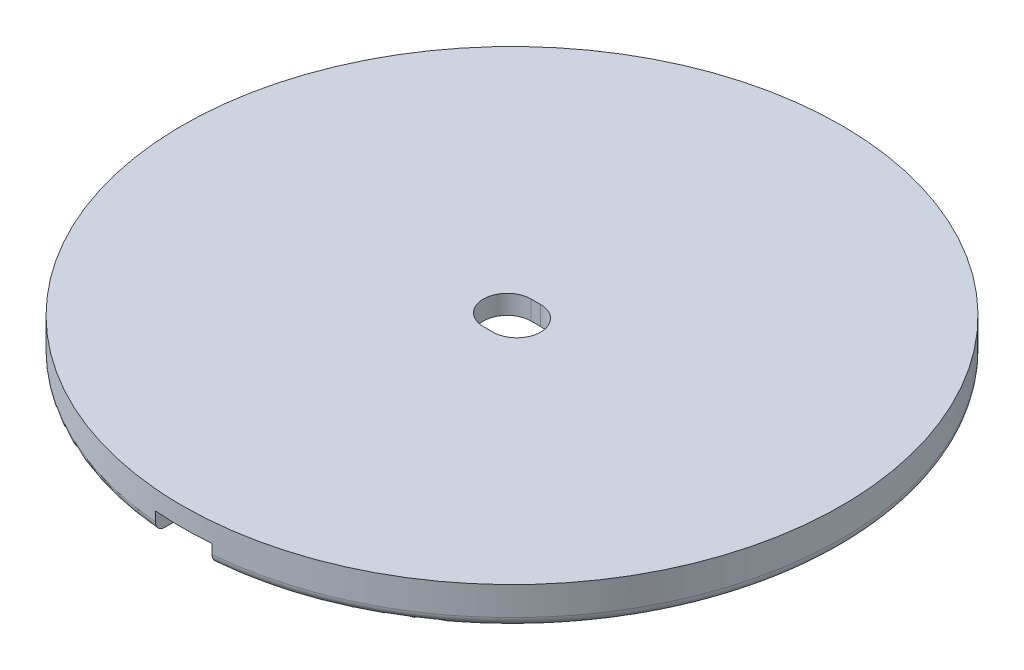
ISO-10303-21;
HEADER;
FILE_DESCRIPTION(('STEP AP214'),'2;1');
FILE_NAME('part.step','',(''),(''),'','','');
FILE_SCHEMA(('AUTOMOTIVE_DESIGN { 1 0 10303 214 1 1 1 1 }'));
ENDSEC;
DATA;
#1=APPLICATION_CONTEXT('core data for automotive mechanical design processes');
#2=APPLICATION_PROTOCOL_DEFINITION('international standard','automotive_design',2000,#1);
#3=PRODUCT_CONTEXT('',#1,'mechanical');
#4=PRODUCT('Part','Part','',(#3));
#5=PRODUCT_RELATED_PRODUCT_CATEGORY('part','',(#4));
#6=PRODUCT_DEFINITION_FORMATION('','',#4);
#7=PRODUCT_DEFINITION_CONTEXT('part definition',#1,'design');
#8=PRODUCT_DEFINITION('design','',#6,#7);
#9=PRODUCT_DEFINITION_SHAPE('','',#8);
#10=(LENGTH_UNIT() NAMED_UNIT(*) SI_UNIT(.MILLI.,.METRE.));
#11=(NAMED_UNIT(*) PLANE_ANGLE_UNIT() SI_UNIT($,.RADIAN.));
#12=(NAMED_UNIT(*) SI_UNIT($,.STERADIAN.) SOLID_ANGLE_UNIT());
#13=UNCERTAINTY_MEASURE_WITH_UNIT(LENGTH_MEASURE(1.E-05),#10,'distance_accuracy_value','');
#14=(GEOMETRIC_REPRESENTATION_CONTEXT(3) GLOBAL_UNCERTAINTY_ASSIGNED_CONTEXT((#13)) GLOBAL_UNIT_ASSIGNED_CONTEXT((#10,
#11,#12)) REPRESENTATION_CONTEXT('',''));
#15=CARTESIAN_POINT('',(0.,0.,0.));
#16=DIRECTION('',(0.,0.,1.));
#17=DIRECTION('',(1.,0.,0.));
#18=AXIS2_PLACEMENT_3D('',#15,#16,#17);
#19=CARTESIAN_POINT('',(0.500000000000001,0.,0.));
#20=DIRECTION('',(0.,1.,0.));
#21=DIRECTION('',(0.,0.,1.));
#22=AXIS2_PLACEMENT_3D('',#19,#20,#21);
#23=CYLINDRICAL_SURFACE('',#22,2.5);
#24=CARTESIAN_POINT('',(0.500000000000001,2.,0.));
#25=DIRECTION('',(0.,-1.,0.));
#26=DIRECTION('',(0.,0.,-1.));
#27=AXIS2_PLACEMENT_3D('',#24,#25,#26);
#28=CIRCLE('',#27,2.5);
#29=CARTESIAN_POINT('',(0.500000000000001,2.,2.5));
#30=VERTEX_POINT('',#29);
#31=CARTESIAN_POINT('',(0.5,2.,-2.5));
#32=VERTEX_POINT('',#31);
#33=EDGE_CURVE('E170',#30,#32,#28,.F.);
#34=ORIENTED_EDGE('',*,*,#33,.F.);
#35=DIRECTION('',(0.,1.,0.));
#36=VECTOR('',#35,1.);
#37=CARTESIAN_POINT('',(0.500000000000001,0.,2.5));
#38=LINE('',#37,#36);
#39=CARTESIAN_POINT('',(0.500000000000001,4.,2.5));
#40=VERTEX_POINT('',#39);
#41=EDGE_CURVE('E197',#30,#40,#38,.T.);
#42=ORIENTED_EDGE('',*,*,#41,.T.);
#43=CARTESIAN_POINT('',(0.500000000000001,4.,0.));
#44=DIRECTION('',(0.,1.,0.));
#45=DIRECTION('',(0.,0.,1.));
#46=AXIS2_PLACEMENT_3D('',#43,#44,#45);
#47=CIRCLE('',#46,2.5);
#48=CARTESIAN_POINT('',(0.5,4.,-2.5));
#49=VERTEX_POINT('',#48);
#50=EDGE_CURVE('E181',#40,#49,#47,.T.);
#51=ORIENTED_EDGE('',*,*,#50,.T.);
#52=DIRECTION('',(0.,1.,0.));
#53=VECTOR('',#52,1.);
#54=CARTESIAN_POINT('',(0.5,0.,-2.5));
#55=LINE('',#54,#53);
#56=EDGE_CURVE('E196',#32,#49,#55,.T.);
#57=ORIENTED_EDGE('',*,*,#56,.F.);
#58=EDGE_LOOP('',(#34,#42,#51,#57));
#59=FACE_BOUND('',#58,.T.);
#60=ADVANCED_FACE('F38',(#59),#23,.F.);
#61=CARTESIAN_POINT('',(0.500000000000001,0.,2.5));
#62=DIRECTION('',(0.,0.,1.));
#63=DIRECTION('',(1.,0.,0.));
#64=AXIS2_PLACEMENT_3D('',#61,#62,#63);
#65=PLANE('',#64);
#66=DIRECTION('',(1.,0.,0.));
#67=VECTOR('',#66,1.);
#68=CARTESIAN_POINT('',(0.,2.,2.5));
#69=LINE('',#68,#67);
#70=CARTESIAN_POINT('',(-0.500000000000001,2.,2.5));
#71=VERTEX_POINT('',#70);
#72=EDGE_CURVE('E300',#71,#30,#69,.T.);
#73=ORIENTED_EDGE('',*,*,#72,.F.);
#74=DIRECTION('',(0.,1.,0.));
#75=VECTOR('',#74,1.);
#76=CARTESIAN_POINT('',(-0.5,0.,2.5));
#77=LINE('',#76,#75);
#78=CARTESIAN_POINT('',(-0.5,4.,2.5));
#79=VERTEX_POINT('',#78);
#80=EDGE_CURVE('E200',#71,#79,#77,.T.);
#81=ORIENTED_EDGE('',*,*,#80,.T.);
#82=DIRECTION('',(1.,0.,0.));
#83=VECTOR('',#82,1.);
#84=CARTESIAN_POINT('',(0.500000000000001,4.,2.5));
#85=LINE('',#84,#83);
#86=EDGE_CURVE('E193',#79,#40,#85,.T.);
#87=ORIENTED_EDGE('',*,*,#86,.T.);
#88=ORIENTED_EDGE('',*,*,#41,.F.);
#89=EDGE_LOOP('',(#73,#81,#87,#88));
#90=FACE_BOUND('',#89,.T.);
#91=ADVANCED_FACE('F239',(#90),#65,.F.);
#92=CARTESIAN_POINT('',(-0.500000000000001,0.,0.));
#93=DIRECTION('',(0.,1.,0.));
#94=DIRECTION('',(0.,0.,1.));
#95=AXIS2_PLACEMENT_3D('',#92,#93,#94);
#96=CYLINDRICAL_SURFACE('',#95,2.5);
#97=CARTESIAN_POINT('',(-0.500000000000001,2.,0.));
#98=DIRECTION('',(0.,-1.,0.));
#99=DIRECTION('',(0.,0.,-1.));
#100=AXIS2_PLACEMENT_3D('',#97,#98,#99);
#101=CIRCLE('',#100,2.5);
#102=CARTESIAN_POINT('',(-0.500000000000001,2.,-2.5));
#103=VERTEX_POINT('',#102);
#104=EDGE_CURVE('E176',#103,#71,#101,.F.);
#105=ORIENTED_EDGE('',*,*,#104,.F.);
#106=DIRECTION('',(0.,1.,0.));
#107=VECTOR('',#106,1.);
#108=CARTESIAN_POINT('',(-0.5,0.,-2.5));
#109=LINE('',#108,#107);
#110=CARTESIAN_POINT('',(-0.5,4.,-2.5));
#111=VERTEX_POINT('',#110);
#112=EDGE_CURVE('E202',#103,#111,#109,.T.);
#113=ORIENTED_EDGE('',*,*,#112,.T.);
#114=CARTESIAN_POINT('',(-0.500000000000001,4.,0.));
#115=DIRECTION('',(0.,1.,0.));
#116=DIRECTION('',(0.,0.,1.));
#117=AXIS2_PLACEMENT_3D('',#114,#115,#116);
#118=CIRCLE('',#117,2.5);
#119=EDGE_CURVE('E190',#111,#79,#118,.T.);
#120=ORIENTED_EDGE('',*,*,#119,.T.);
#121=ORIENTED_EDGE('',*,*,#80,.F.);
#122=EDGE_LOOP('',(#105,#113,#120,#121));
#123=FACE_BOUND('',#122,.T.);
#124=ADVANCED_FACE('F242',(#123),#96,.F.);
#125=CARTESIAN_POINT('',(0.5,0.,-2.5));
#126=DIRECTION('',(0.,0.,-1.));
#127=DIRECTION('',(-1.,0.,0.));
#128=AXIS2_PLACEMENT_3D('',#125,#126,#127);
#129=PLANE('',#128);
#130=DIRECTION('',(-1.,0.,0.));
#131=VECTOR('',#130,1.);
#132=CARTESIAN_POINT('',(0.,2.,-2.5));
#133=LINE('',#132,#131);
#134=EDGE_CURVE('E165',#32,#103,#133,.T.);
#135=ORIENTED_EDGE('',*,*,#134,.F.);
#136=ORIENTED_EDGE('',*,*,#56,.T.);
#137=DIRECTION('',(-1.,0.,0.));
#138=VECTOR('',#137,1.);
#139=CARTESIAN_POINT('',(0.5,4.,-2.5));
#140=LINE('',#139,#138);
#141=EDGE_CURVE('E187',#49,#111,#140,.T.);
#142=ORIENTED_EDGE('',*,*,#141,.T.);
#143=ORIENTED_EDGE('',*,*,#112,.F.);
#144=EDGE_LOOP('',(#135,#136,#142,#143));
#145=FACE_BOUND('',#144,.T.);
#146=ADVANCED_FACE('F246',(#145),#129,.F.);
#147=CARTESIAN_POINT('',(0.,4.,0.));
#148=DIRECTION('',(0.,-1.,0.));
#149=DIRECTION('',(0.,0.,-1.));
#150=AXIS2_PLACEMENT_3D('',#147,#148,#149);
#151=CYLINDRICAL_SURFACE('',#150,34.5);
#152=CARTESIAN_POINT('',(0.,4.,0.));
#153=DIRECTION('',(0.,1.,0.));
#154=DIRECTION('',(0.,0.,1.));
#155=AXIS2_PLACEMENT_3D('',#152,#153,#154);
#156=CIRCLE('',#155,34.5);
#157=CARTESIAN_POINT('',(0.,4.,34.5));
#158=VERTEX_POINT('',#157);
#159=EDGE_CURVE('E199',#158,#158,#156,.T.);
#160=ORIENTED_EDGE('',*,*,#159,.F.);
#161=EDGE_LOOP('',(#160));
#162=FACE_BOUND('',#161,.T.);
#163=DIRECTION('',(0.,-1.,0.));
#164=VECTOR('',#163,1.);
#165=CARTESIAN_POINT('',(2.96579845369393,4.,34.3722859224124));
#166=LINE('',#165,#164);
#167=CARTESIAN_POINT('',(2.96579845369393,2.,34.3722859224123));
#168=VERTEX_POINT('',#167);
#169=CARTESIAN_POINT('',(2.96579845369393,1.,34.3722859224124));
#170=VERTEX_POINT('',#169);
#171=EDGE_CURVE('E268',#168,#170,#166,.T.);
#172=ORIENTED_EDGE('',*,*,#171,.T.);
#173=CARTESIAN_POINT('',(0.,1.,0.));
#174=DIRECTION('',(0.,1.,0.));
#175=DIRECTION('',(0.,0.,1.));
#176=AXIS2_PLACEMENT_3D('',#173,#174,#175);
#177=CIRCLE('',#176,34.5);
#178=CARTESIAN_POINT('',(-2.96579845369394,1.,34.3722859224124));
#179=VERTEX_POINT('',#178);
#180=EDGE_CURVE('E208',#170,#179,#177,.T.);
#181=ORIENTED_EDGE('',*,*,#180,.T.);
#182=DIRECTION('',(0.,-1.,0.));
#183=VECTOR('',#182,1.);
#184=CARTESIAN_POINT('',(-2.96579845369394,4.,34.3722859224124));
#185=LINE('',#184,#183);
#186=CARTESIAN_POINT('',(-2.96579845369393,2.,34.3722859224123));
#187=VERTEX_POINT('',#186);
#188=EDGE_CURVE('E294',#179,#187,#185,.F.);
#189=ORIENTED_EDGE('',*,*,#188,.T.);
#190=CARTESIAN_POINT('',(0.,2.,0.));
#191=DIRECTION('',(0.,-1.,0.));
#192=DIRECTION('',(0.,0.,-1.));
#193=AXIS2_PLACEMENT_3D('',#190,#191,#192);
#194=CIRCLE('',#193,34.5);
#195=EDGE_CURVE('E177',#168,#187,#194,.T.);
#196=ORIENTED_EDGE('',*,*,#195,.F.);
#197=EDGE_LOOP('',(#172,#181,#189,#196));
#198=FACE_BOUND('',#197,.T.);
#199=ADVANCED_FACE('F250',(#162,#198),#151,.T.);
#200=CARTESIAN_POINT('',(0.,4.,0.));
#201=DIRECTION('',(0.,1.,0.));
#202=DIRECTION('',(0.,0.,1.));
#203=AXIS2_PLACEMENT_3D('',#200,#201,#202);
#204=PLANE('',#203);
#205=ORIENTED_EDGE('',*,*,#50,.F.);
#206=ORIENTED_EDGE('',*,*,#86,.F.);
#207=ORIENTED_EDGE('',*,*,#119,.F.);
#208=ORIENTED_EDGE('',*,*,#141,.F.);
#209=EDGE_LOOP('',(#205,#206,#207,#208));
#210=FACE_BOUND('',#209,.T.);
#211=ORIENTED_EDGE('',*,*,#159,.T.);
#212=EDGE_LOOP('',(#211));
#213=FACE_BOUND('',#212,.T.);
#214=ADVANCED_FACE('F255',(#210,#213),#204,.T.);
#215=CARTESIAN_POINT('',(0.,0.,0.));
#216=DIRECTION('',(0.,1.,0.));
#217=DIRECTION('',(0.,0.,1.));
#218=AXIS2_PLACEMENT_3D('',#215,#216,#217);
#219=PLANE('',#218);
#220=DIRECTION('',(0.,0.,-1.));
#221=VECTOR('',#220,1.);
#222=CARTESIAN_POINT('',(-2.96579845369394,0.,6.88868924629836));
#223=LINE('',#222,#221);
#224=CARTESIAN_POINT('',(-2.96579845369394,0.,33.3684587527213));
#225=VERTEX_POINT('',#224);
#226=CARTESIAN_POINT('',(-2.96579845369393,0.,32.3643946263802));
#227=VERTEX_POINT('',#226);
#228=EDGE_CURVE('E283',#225,#227,#223,.T.);
#229=ORIENTED_EDGE('',*,*,#228,.F.);
#230=CARTESIAN_POINT('',(0.,0.,0.));
#231=DIRECTION('',(0.,1.,0.));
#232=DIRECTION('',(0.,0.,1.));
#233=AXIS2_PLACEMENT_3D('',#230,#231,#232);
#234=CIRCLE('',#233,33.5);
#235=CARTESIAN_POINT('',(2.96579845369393,0.,33.3684587527213));
#236=VERTEX_POINT('',#235);
#237=EDGE_CURVE('E52',#225,#236,#234,.F.);
#238=ORIENTED_EDGE('',*,*,#237,.T.);
#239=DIRECTION('',(0.,0.,1.));
#240=VECTOR('',#239,1.);
#241=CARTESIAN_POINT('',(2.96579845369393,0.,6.88868924629836));
#242=LINE('',#241,#240);
#243=CARTESIAN_POINT('',(2.96579845369393,0.,32.3643946263802));
#244=VERTEX_POINT('',#243);
#245=EDGE_CURVE('E277',#244,#236,#242,.T.);
#246=ORIENTED_EDGE('',*,*,#245,.F.);
#247=CARTESIAN_POINT('',(0.,0.,0.));
#248=DIRECTION('',(0.,-1.,0.));
#249=DIRECTION('',(0.,0.,-1.));
#250=AXIS2_PLACEMENT_3D('',#247,#248,#249);
#251=CIRCLE('',#250,32.5);
#252=EDGE_CURVE('E168',#227,#244,#251,.T.);
#253=ORIENTED_EDGE('',*,*,#252,.F.);
#254=EDGE_LOOP('',(#229,#238,#246,#253));
#255=FACE_BOUND('',#254,.T.);
#256=ADVANCED_FACE('F231',(#255),#219,.F.);
#257=CARTESIAN_POINT('',(0.,2.,0.));
#258=DIRECTION('',(0.,-1.,0.));
#259=DIRECTION('',(0.,0.,-1.));
#260=AXIS2_PLACEMENT_3D('',#257,#258,#259);
#261=CYLINDRICAL_SURFACE('',#260,7.5);
#262=CARTESIAN_POINT('',(0.,0.,0.));
#263=DIRECTION('',(0.,-1.,0.));
#264=DIRECTION('',(0.,0.,-1.));
#265=AXIS2_PLACEMENT_3D('',#262,#263,#264);
#266=CIRCLE('',#265,7.5);
#267=CARTESIAN_POINT('',(-2.96579845369394,0.,6.88868924629836));
#268=VERTEX_POINT('',#267);
#269=CARTESIAN_POINT('',(2.96579845369393,0.,6.88868924629836));
#270=VERTEX_POINT('',#269);
#271=EDGE_CURVE('E174',#268,#270,#266,.T.);
#272=ORIENTED_EDGE('',*,*,#271,.T.);
#273=DIRECTION('',(0.,-1.,0.));
#274=VECTOR('',#273,1.);
#275=CARTESIAN_POINT('',(2.96579845369393,2.,6.88868924629836));
#276=LINE('',#275,#274);
#277=CARTESIAN_POINT('',(2.96579845369393,2.,6.88868924629836));
#278=VERTEX_POINT('',#277);
#279=EDGE_CURVE('E160',#278,#270,#276,.T.);
#280=ORIENTED_EDGE('',*,*,#279,.F.);
#281=CARTESIAN_POINT('',(0.,2.,0.));
#282=DIRECTION('',(0.,-1.,0.));
#283=DIRECTION('',(0.,0.,-1.));
#284=AXIS2_PLACEMENT_3D('',#281,#282,#283);
#285=CIRCLE('',#284,7.5);
#286=CARTESIAN_POINT('',(-2.96579845369394,2.,6.88868924629836));
#287=VERTEX_POINT('',#286);
#288=EDGE_CURVE('E144',#287,#278,#285,.T.);
#289=ORIENTED_EDGE('',*,*,#288,.F.);
#290=DIRECTION('',(0.,-1.,0.));
#291=VECTOR('',#290,1.);
#292=CARTESIAN_POINT('',(-2.96579845369394,2.,6.88868924629836));
#293=LINE('',#292,#291);
#294=EDGE_CURVE('E153',#287,#268,#293,.T.);
#295=ORIENTED_EDGE('',*,*,#294,.T.);
#296=EDGE_LOOP('',(#272,#280,#289,#295));
#297=FACE_BOUND('',#296,.T.);
#298=ADVANCED_FACE('F163',(#297),#261,.F.);
#299=CARTESIAN_POINT('',(0.,2.,0.));
#300=DIRECTION('',(0.,-1.,0.));
#301=DIRECTION('',(0.,0.,-1.));
#302=AXIS2_PLACEMENT_3D('',#299,#300,#301);
#303=PLANE('',#302);
#304=ORIENTED_EDGE('',*,*,#288,.T.);
#305=DIRECTION('',(0.,0.,1.));
#306=VECTOR('',#305,1.);
#307=CARTESIAN_POINT('',(2.96579845369393,2.,6.88868924629836));
#308=LINE('',#307,#306);
#309=CARTESIAN_POINT('',(2.96579845369393,2.,12.1430654915498));
#310=VERTEX_POINT('',#309);
#311=EDGE_CURVE('E150',#278,#310,#308,.T.);
#312=ORIENTED_EDGE('',*,*,#311,.T.);
#313=CARTESIAN_POINT('',(0.,2.,0.));
#314=DIRECTION('',(0.,-1.,0.));
#315=DIRECTION('',(0.,0.,-1.));
#316=AXIS2_PLACEMENT_3D('',#313,#314,#315);
#317=CIRCLE('',#316,12.5);
#318=CARTESIAN_POINT('',(-2.96579845369394,2.,12.1430654915498));
#319=VERTEX_POINT('',#318);
#320=EDGE_CURVE('E146',#319,#310,#317,.T.);
#321=ORIENTED_EDGE('',*,*,#320,.F.);
#322=DIRECTION('',(0.,0.,-1.));
#323=VECTOR('',#322,1.);
#324=CARTESIAN_POINT('',(-2.96579845369394,2.,6.88868924629836));
#325=LINE('',#324,#323);
#326=EDGE_CURVE('E138',#319,#287,#325,.T.);
#327=ORIENTED_EDGE('',*,*,#326,.T.);
#328=EDGE_LOOP('',(#304,#312,#321,#327));
#329=FACE_BOUND('',#328,.T.);
#330=ORIENTED_EDGE('',*,*,#104,.T.);
#331=ORIENTED_EDGE('',*,*,#72,.T.);
#332=ORIENTED_EDGE('',*,*,#33,.T.);
#333=ORIENTED_EDGE('',*,*,#134,.T.);
#334=EDGE_LOOP('',(#330,#331,#332,#333));
#335=FACE_BOUND('',#334,.T.);
#336=CARTESIAN_POINT('',(0.,2.,0.));
#337=DIRECTION('',(0.,-1.,0.));
#338=DIRECTION('',(0.,0.,-1.));
#339=AXIS2_PLACEMENT_3D('',#336,#337,#338);
#340=CIRCLE('',#339,32.5);
#341=CARTESIAN_POINT('',(-2.96579845369394,2.,32.3643946263802));
#342=VERTEX_POINT('',#341);
#343=CARTESIAN_POINT('',(2.96579845369393,2.,32.3643946263802));
#344=VERTEX_POINT('',#343);
#345=EDGE_CURVE('E179',#342,#344,#340,.T.);
#346=ORIENTED_EDGE('',*,*,#345,.T.);
#347=EDGE_CURVE('E287',#344,#168,#308,.T.);
#348=ORIENTED_EDGE('',*,*,#347,.T.);
#349=ORIENTED_EDGE('',*,*,#195,.T.);
#350=EDGE_CURVE('E149',#187,#342,#325,.T.);
#351=ORIENTED_EDGE('',*,*,#350,.T.);
#352=EDGE_LOOP('',(#346,#348,#349,#351));
#353=FACE_BOUND('',#352,.T.);
#354=ADVANCED_FACE('F140',(#329,#335,#353),#303,.T.);
#355=CARTESIAN_POINT('',(0.,2.,0.));
#356=DIRECTION('',(0.,-1.,0.));
#357=DIRECTION('',(0.,0.,-1.));
#358=AXIS2_PLACEMENT_3D('',#355,#356,#357);
#359=CYLINDRICAL_SURFACE('',#358,12.5);
#360=DIRECTION('',(0.,-1.,0.));
#361=VECTOR('',#360,1.);
#362=CARTESIAN_POINT('',(2.96579845369393,2.,12.1430654915498));
#363=LINE('',#362,#361);
#364=CARTESIAN_POINT('',(2.96579845369393,0.,12.1430654915498));
#365=VERTEX_POINT('',#364);
#366=EDGE_CURVE('E273',#365,#310,#363,.F.);
#367=ORIENTED_EDGE('',*,*,#366,.F.);
#368=CARTESIAN_POINT('',(0.,0.,0.));
#369=DIRECTION('',(0.,-1.,0.));
#370=DIRECTION('',(0.,0.,-1.));
#371=AXIS2_PLACEMENT_3D('',#368,#369,#370);
#372=CIRCLE('',#371,12.5);
#373=CARTESIAN_POINT('',(-2.96579845369394,0.,12.1430654915498));
#374=VERTEX_POINT('',#373);
#375=EDGE_CURVE('E164',#374,#365,#372,.T.);
#376=ORIENTED_EDGE('',*,*,#375,.F.);
#377=DIRECTION('',(0.,-1.,0.));
#378=VECTOR('',#377,1.);
#379=CARTESIAN_POINT('',(-2.96579845369394,2.,12.1430654915498));
#380=LINE('',#379,#378);
#381=EDGE_CURVE('E292',#319,#374,#380,.T.);
#382=ORIENTED_EDGE('',*,*,#381,.F.);
#383=ORIENTED_EDGE('',*,*,#320,.T.);
#384=EDGE_LOOP('',(#367,#376,#382,#383));
#385=FACE_BOUND('',#384,.T.);
#386=ADVANCED_FACE('F228',(#385),#359,.T.);
#387=CARTESIAN_POINT('',(0.,2.,0.));
#388=DIRECTION('',(0.,-1.,0.));
#389=DIRECTION('',(0.,0.,-1.));
#390=AXIS2_PLACEMENT_3D('',#387,#388,#389);
#391=CYLINDRICAL_SURFACE('',#390,32.5);
#392=ORIENTED_EDGE('',*,*,#252,.T.);
#393=DIRECTION('',(0.,-1.,0.));
#394=VECTOR('',#393,1.);
#395=CARTESIAN_POINT('',(2.96579845369393,2.,32.3643946263802));
#396=LINE('',#395,#394);
#397=EDGE_CURVE('E279',#244,#344,#396,.F.);
#398=ORIENTED_EDGE('',*,*,#397,.T.);
#399=ORIENTED_EDGE('',*,*,#345,.F.);
#400=DIRECTION('',(0.,-1.,0.));
#401=VECTOR('',#400,1.);
#402=CARTESIAN_POINT('',(-2.96579845369394,2.,32.3643946263802));
#403=LINE('',#402,#401);
#404=EDGE_CURVE('E288',#342,#227,#403,.T.);
#405=ORIENTED_EDGE('',*,*,#404,.T.);
#406=EDGE_LOOP('',(#392,#398,#399,#405));
#407=FACE_BOUND('',#406,.T.);
#408=ADVANCED_FACE('F232',(#407),#391,.F.);
#409=ORIENTED_EDGE('',*,*,#375,.T.);
#410=EDGE_CURVE('E281',#270,#365,#242,.T.);
#411=ORIENTED_EDGE('',*,*,#410,.F.);
#412=ORIENTED_EDGE('',*,*,#271,.F.);
#413=DIRECTION('',(0.,0.,1.));
#414=VECTOR('',#413,1.);
#415=CARTESIAN_POINT('',(-2.96579845369394,0.,0.));
#416=LINE('',#415,#414);
#417=EDGE_CURVE('E156',#268,#374,#416,.T.);
#418=ORIENTED_EDGE('',*,*,#417,.T.);
#419=EDGE_LOOP('',(#409,#411,#412,#418));
#420=FACE_BOUND('',#419,.T.);
#421=ADVANCED_FACE('F224',(#420),#219,.F.);
#422=CARTESIAN_POINT('',(2.96579845369393,2.,6.88868924629836));
#423=DIRECTION('',(1.,0.,0.));
#424=DIRECTION('',(0.,0.,-1.));
#425=AXIS2_PLACEMENT_3D('',#422,#423,#424);
#426=PLANE('',#425);
#427=ORIENTED_EDGE('',*,*,#366,.T.);
#428=ORIENTED_EDGE('',*,*,#311,.F.);
#429=ORIENTED_EDGE('',*,*,#279,.T.);
#430=ORIENTED_EDGE('',*,*,#410,.T.);
#431=EDGE_LOOP('',(#427,#428,#429,#430));
#432=FACE_BOUND('',#431,.T.);
#433=ADVANCED_FACE('F219',(#432),#426,.F.);
#434=CARTESIAN_POINT('',(-2.96579845369394,2.,6.88868924629836));
#435=DIRECTION('',(-1.,0.,0.));
#436=DIRECTION('',(0.,0.,1.));
#437=AXIS2_PLACEMENT_3D('',#434,#435,#436);
#438=PLANE('',#437);
#439=ORIENTED_EDGE('',*,*,#381,.T.);
#440=ORIENTED_EDGE('',*,*,#417,.F.);
#441=ORIENTED_EDGE('',*,*,#294,.F.);
#442=ORIENTED_EDGE('',*,*,#326,.F.);
#443=EDGE_LOOP('',(#439,#440,#441,#442));
#444=FACE_BOUND('',#443,.T.);
#445=ADVANCED_FACE('F154',(#444),#438,.F.);
#446=ORIENTED_EDGE('',*,*,#245,.T.);
#447=CARTESIAN_POINT('',(2.96579845369393,0.,33.3684587527214));
#448=CARTESIAN_POINT('',(2.96579845369393,2.47162634345699E-07,33.3967813921656));
#449=CARTESIAN_POINT('',(2.96579845369393,0.00119457170193105,33.4250905014847));
#450=CARTESIAN_POINT('',(2.96579845369393,0.00595976220493954,33.4815068288699));
#451=CARTESIAN_POINT('',(2.96579845369393,0.00953053509060218,33.5096140547994));
#452=CARTESIAN_POINT('',(2.96579845369393,0.0237756571644055,33.5932883091058));
#453=CARTESIAN_POINT('',(2.96579845369393,0.0379828926781715,33.6482959200199));
#454=CARTESIAN_POINT('',(2.96579845369393,0.0754344612847372,33.7551451991758));
#455=CARTESIAN_POINT('',(2.96579845369393,0.0986835220506376,33.8069851947407));
#456=CARTESIAN_POINT('',(2.96579845369393,0.153567620309897,33.9060134814707));
#457=CARTESIAN_POINT('',(2.96579845369393,0.185200896497915,33.9532027467802));
#458=CARTESIAN_POINT('',(2.96579845369393,0.255900312016768,34.0414931135579));
#459=CARTESIAN_POINT('',(2.96579845369393,0.294952584306808,34.0826053228735));
#460=CARTESIAN_POINT('',(2.96579845369393,0.379437137189378,34.1576698193498));
#461=CARTESIAN_POINT('',(2.96579845369393,0.4248706203791,34.1916207538788));
#462=CARTESIAN_POINT('',(2.96579845369393,0.520647426257819,34.2512610038043));
#463=CARTESIAN_POINT('',(2.96579845369393,0.570973360916336,34.2769782767453));
#464=CARTESIAN_POINT('',(2.96579845369393,0.6752275848019,34.3195526628413));
#465=CARTESIAN_POINT('',(2.96579845369393,0.729153547253344,34.3364154375419));
#466=CARTESIAN_POINT('',(2.96579845369393,0.819524823070958,34.3564781282309));
#467=CARTESIAN_POINT('',(2.96579845369393,0.85538860765323,34.3624025042396));
#468=CARTESIAN_POINT('',(2.96579845369393,0.927496438252744,34.3703057635193));
#469=CARTESIAN_POINT('',(2.96579845369393,0.963739869447765,34.3722902580952));
#470=CARTESIAN_POINT('',(2.96579845369393,1.,34.3722859224124));
#471=B_SPLINE_CURVE_WITH_KNOTS('',3,(#447,#448,#449,#450,#451,#452,#453,#454,#455,#456,#457,
#458,#459,#460,#461,#462,#463,#464,#465,#466,#467,#468,#469,#470),.UNSPECIFIED.,.F.,.F.,(4,2,2,
2,2,2,2,2,2,2,2,4),(0.,0.0849158461812794,0.169828366670162,0.339392743578644,0.509045899580224,
0.678663444080643,0.84796701686482,1.01730253936599,1.1860568272027,1.35470308214241,
1.46355181110006,1.5722454026944),.UNSPECIFIED.);
#472=EDGE_CURVE('E12',#236,#170,#471,.T.);
#473=ORIENTED_EDGE('',*,*,#472,.T.);
#474=ORIENTED_EDGE('',*,*,#171,.F.);
#475=ORIENTED_EDGE('',*,*,#347,.F.);
#476=ORIENTED_EDGE('',*,*,#397,.F.);
#477=EDGE_LOOP('',(#446,#473,#474,#475,#476));
#478=FACE_BOUND('',#477,.T.);
#479=ADVANCED_FACE('F218',(#478),#426,.F.);
#480=ORIENTED_EDGE('',*,*,#188,.F.);
#481=CARTESIAN_POINT('',(-2.96579845369394,1.,34.3722859224124));
#482=CARTESIAN_POINT('',(-2.96579845369394,0.971941589540463,34.3722857891581));
#483=CARTESIAN_POINT('',(-2.96579845369394,0.943896646823824,34.3710998747612));
#484=CARTESIAN_POINT('',(-2.96579845369394,0.888008014843123,34.3663691436783));
#485=CARTESIAN_POINT('',(-2.96579845369394,0.860164314562261,34.3628244571247));
#486=CARTESIAN_POINT('',(-2.96579845369394,0.77728874535402,34.3486875548049));
#487=CARTESIAN_POINT('',(-2.96579845369394,0.722812926072736,34.3345923933028));
#488=CARTESIAN_POINT('',(-2.96579845369394,0.617003872360629,34.2974600527126));
#489=CARTESIAN_POINT('',(-2.96579845369394,0.565672047461089,34.2744188963968));
#490=CARTESIAN_POINT('',(-2.96579845369394,0.467597178206866,34.2200611855529));
#491=CARTESIAN_POINT('',(-2.96579845369394,0.420853459760594,34.1887458491836));
#492=CARTESIAN_POINT('',(-2.96579845369394,0.333196821888582,34.1186811694866));
#493=CARTESIAN_POINT('',(-2.96579845369394,0.292293334656739,34.0799200324547));
#494=CARTESIAN_POINT('',(-2.96579845369394,0.217538189606133,33.9960934818917));
#495=CARTESIAN_POINT('',(-2.96579845369394,0.183687955306061,33.9510267988095));
#496=CARTESIAN_POINT('',(-2.96579845369394,0.123878232020651,33.8557027157389));
#497=CARTESIAN_POINT('',(-2.96579845369394,0.0979484366320501,33.805426706521));
#498=CARTESIAN_POINT('',(-2.96579845369394,0.0548765372356878,33.7012544333212));
#499=CARTESIAN_POINT('',(-2.96579845369394,0.0377297785304895,33.6473601040861));
#500=CARTESIAN_POINT('',(-2.96579845369394,0.0168300506435986,33.5557079583346));
#501=CARTESIAN_POINT('',(-2.96579845369394,0.0105225049225237,33.518512222031));
#502=CARTESIAN_POINT('',(-2.96579845369394,0.00210793232930831,33.4437022576851));
#503=CARTESIAN_POINT('',(-2.96579845369394,-5.05026192622484E-06,33.4060886993663));
#504=CARTESIAN_POINT('',(-2.96579845369394,0.,33.3684587527214));
#505=B_SPLINE_CURVE_WITH_KNOTS('',3,(#481,#482,#483,#484,#485,#486,#487,#488,#489,#490,#491,
#492,#493,#494,#495,#496,#497,#498,#499,#500,#501,#502,#503,#504),.UNSPECIFIED.,.F.,.F.,(4,2,2,
2,2,2,2,2,2,2,2,4),(0.,0.084123440604345,0.168242240539181,0.336185199448616,0.504202908418698,
0.672195894904416,0.840457199682483,1.00875243087814,1.17767106613878,1.34650008766103,
1.45945923879576,1.57225788798694),.UNSPECIFIED.);
#506=EDGE_CURVE('E66',#179,#225,#505,.T.);
#507=ORIENTED_EDGE('',*,*,#506,.T.);
#508=ORIENTED_EDGE('',*,*,#228,.T.);
#509=ORIENTED_EDGE('',*,*,#404,.F.);
#510=ORIENTED_EDGE('',*,*,#350,.F.);
#511=EDGE_LOOP('',(#480,#507,#508,#509,#510));
#512=FACE_BOUND('',#511,.T.);
#513=ADVANCED_FACE('F220',(#512),#438,.F.);
#514=CARTESIAN_POINT('',(0.,1.,0.));
#515=DIRECTION('',(0.,1.,0.));
#516=DIRECTION('',(0.,0.,1.));
#517=AXIS2_PLACEMENT_3D('',#514,#515,#516);
#518=TOROIDAL_SURFACE('',#517,33.5,1.);
#519=ORIENTED_EDGE('',*,*,#472,.F.);
#520=ORIENTED_EDGE('',*,*,#237,.F.);
#521=ORIENTED_EDGE('',*,*,#506,.F.);
#522=ORIENTED_EDGE('',*,*,#180,.F.);
#523=EDGE_LOOP('',(#519,#520,#521,#522));
#524=FACE_BOUND('',#523,.T.);
#525=ADVANCED_FACE('F40',(#524),#518,.T.);
#526=CLOSED_SHELL('',(#60,#91,#124,#146,#199,#214,#256,#298,#354,#386,#408,#421,#433,#445,#479,
#513,#525));
#527=MANIFOLD_SOLID_BREP('B2',#526);
#528=ADVANCED_BREP_SHAPE_REPRESENTATION('',(#18,#527),#14);
#529=SHAPE_DEFINITION_REPRESENTATION(#9,#528);
ENDSEC;
END-ISO-10303-21;
